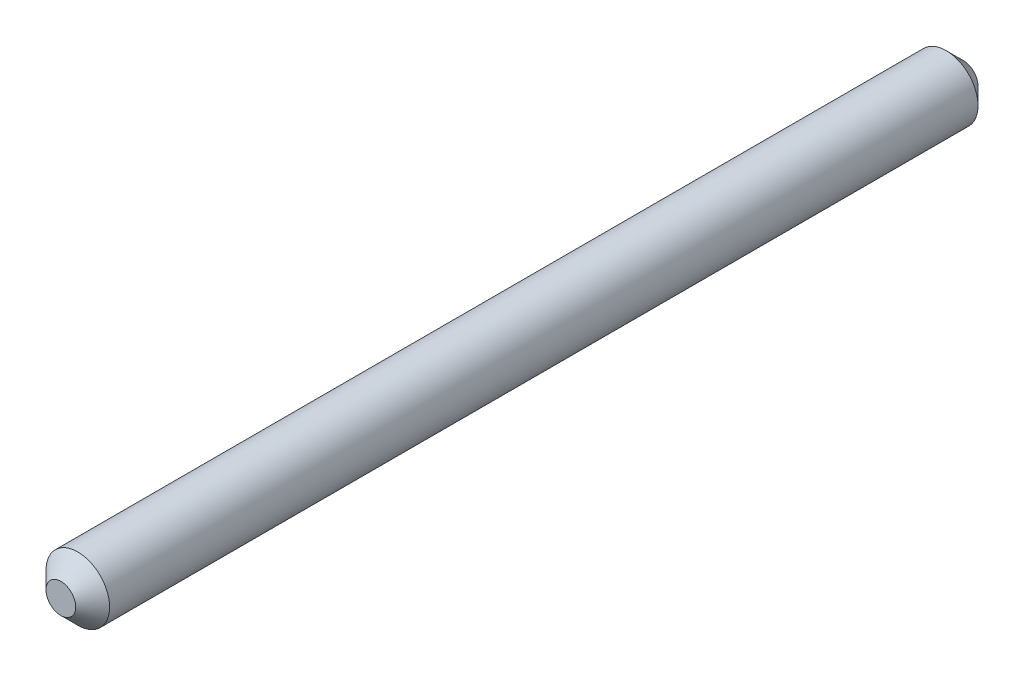
ISO-10303-21;
HEADER;
FILE_DESCRIPTION(('STEP AP214'),'2;1');
FILE_NAME('part.step','',(''),(''),'','','');
FILE_SCHEMA(('AUTOMOTIVE_DESIGN { 1 0 10303 214 1 1 1 1 }'));
ENDSEC;
DATA;
#1=APPLICATION_CONTEXT('core data for automotive mechanical design processes');
#2=APPLICATION_PROTOCOL_DEFINITION('international standard','automotive_design',2000,#1);
#3=PRODUCT_CONTEXT('',#1,'mechanical');
#4=PRODUCT('Part','Part','',(#3));
#5=PRODUCT_RELATED_PRODUCT_CATEGORY('part','',(#4));
#6=PRODUCT_DEFINITION_FORMATION('','',#4);
#7=PRODUCT_DEFINITION_CONTEXT('part definition',#1,'design');
#8=PRODUCT_DEFINITION('design','',#6,#7);
#9=PRODUCT_DEFINITION_SHAPE('','',#8);
#10=(LENGTH_UNIT() NAMED_UNIT(*) SI_UNIT(.MILLI.,.METRE.));
#11=(NAMED_UNIT(*) PLANE_ANGLE_UNIT() SI_UNIT($,.RADIAN.));
#12=(NAMED_UNIT(*) SI_UNIT($,.STERADIAN.) SOLID_ANGLE_UNIT());
#13=UNCERTAINTY_MEASURE_WITH_UNIT(LENGTH_MEASURE(1.E-05),#10,'distance_accuracy_value','');
#14=(GEOMETRIC_REPRESENTATION_CONTEXT(3) GLOBAL_UNCERTAINTY_ASSIGNED_CONTEXT((#13)) GLOBAL_UNIT_ASSIGNED_CONTEXT((#10,
#11,#12)) REPRESENTATION_CONTEXT('',''));
#15=CARTESIAN_POINT('',(0.,0.,0.));
#16=DIRECTION('',(0.,0.,1.));
#17=DIRECTION('',(1.,0.,0.));
#18=AXIS2_PLACEMENT_3D('',#15,#16,#17);
#19=CARTESIAN_POINT('',(0.,0.,-67.564));
#20=DIRECTION('',(0.,0.,1.));
#21=DIRECTION('',(1.,0.,0.));
#22=AXIS2_PLACEMENT_3D('',#19,#20,#21);
#23=CYLINDRICAL_SURFACE('',#22,2.38125);
#24=CARTESIAN_POINT('',(0.,0.,-66.294));
#25=DIRECTION('',(0.,0.,1.));
#26=DIRECTION('',(1.,0.,0.));
#27=AXIS2_PLACEMENT_3D('',#24,#25,#26);
#28=CIRCLE('',#27,2.38125);
#29=CARTESIAN_POINT('',(2.38125,0.,-66.294));
#30=VERTEX_POINT('',#29);
#31=EDGE_CURVE('E42',#30,#30,#28,.T.);
#32=ORIENTED_EDGE('',*,*,#31,.T.);
#33=EDGE_LOOP('',(#32));
#34=FACE_BOUND('',#33,.T.);
#35=CARTESIAN_POINT('',(0.,0.,-1.26999999999999));
#36=DIRECTION('',(0.,0.,1.));
#37=DIRECTION('',(1.,0.,0.));
#38=AXIS2_PLACEMENT_3D('',#35,#36,#37);
#39=CIRCLE('',#38,2.38125);
#40=CARTESIAN_POINT('',(2.38125,0.,-1.26999999999999));
#41=VERTEX_POINT('',#40);
#42=EDGE_CURVE('E46',#41,#41,#39,.F.);
#43=ORIENTED_EDGE('',*,*,#42,.T.);
#44=EDGE_LOOP('',(#43));
#45=FACE_BOUND('',#44,.T.);
#46=ADVANCED_FACE('F31',(#34,#45),#23,.T.);
#47=CARTESIAN_POINT('',(0.,0.,-67.564));
#48=DIRECTION('',(0.,0.,1.));
#49=DIRECTION('',(1.,0.,0.));
#50=AXIS2_PLACEMENT_3D('',#47,#48,#49);
#51=PLANE('',#50);
#52=CARTESIAN_POINT('',(0.,0.,-67.564));
#53=DIRECTION('',(0.,0.,1.));
#54=DIRECTION('',(1.,0.,0.));
#55=AXIS2_PLACEMENT_3D('',#52,#53,#54);
#56=CIRCLE('',#55,1.11124999999999);
#57=CARTESIAN_POINT('',(1.11124999999999,0.,-67.564));
#58=VERTEX_POINT('',#57);
#59=EDGE_CURVE('E38',#58,#58,#56,.F.);
#60=ORIENTED_EDGE('',*,*,#59,.T.);
#61=EDGE_LOOP('',(#60));
#62=FACE_BOUND('',#61,.T.);
#63=ADVANCED_FACE('F62',(#62),#51,.F.);
#64=CARTESIAN_POINT('',(0.,0.,0.));
#65=DIRECTION('',(0.,0.,1.));
#66=DIRECTION('',(1.,0.,0.));
#67=AXIS2_PLACEMENT_3D('',#64,#65,#66);
#68=PLANE('',#67);
#69=CARTESIAN_POINT('',(0.,0.,0.));
#70=DIRECTION('',(0.,0.,1.));
#71=DIRECTION('',(1.,0.,0.));
#72=AXIS2_PLACEMENT_3D('',#69,#70,#71);
#73=CIRCLE('',#72,1.11125);
#74=CARTESIAN_POINT('',(1.11125,0.,0.));
#75=VERTEX_POINT('',#74);
#76=EDGE_CURVE('E10',#75,#75,#73,.T.);
#77=ORIENTED_EDGE('',*,*,#76,.T.);
#78=EDGE_LOOP('',(#77));
#79=FACE_BOUND('',#78,.T.);
#80=ADVANCED_FACE('F59',(#79),#68,.T.);
#81=CARTESIAN_POINT('',(0.,0.,-66.294));
#82=DIRECTION('',(0.,0.,1.));
#83=DIRECTION('',(1.,0.,0.));
#84=AXIS2_PLACEMENT_3D('',#81,#82,#83);
#85=CONICAL_SURFACE('',#84,2.38125,0.785398163397448);
#86=ORIENTED_EDGE('',*,*,#59,.F.);
#87=EDGE_LOOP('',(#86));
#88=FACE_BOUND('',#87,.T.);
#89=ORIENTED_EDGE('',*,*,#31,.F.);
#90=EDGE_LOOP('',(#89));
#91=FACE_BOUND('',#90,.T.);
#92=ADVANCED_FACE('F55',(#88,#91),#85,.T.);
#93=CARTESIAN_POINT('',(0.,0.,0.));
#94=DIRECTION('',(0.,0.,-1.));
#95=DIRECTION('',(-1.,0.,0.));
#96=AXIS2_PLACEMENT_3D('',#93,#94,#95);
#97=CONICAL_SURFACE('',#96,1.11125,0.785398163397451);
#98=ORIENTED_EDGE('',*,*,#42,.F.);
#99=EDGE_LOOP('',(#98));
#100=FACE_BOUND('',#99,.T.);
#101=ORIENTED_EDGE('',*,*,#76,.F.);
#102=EDGE_LOOP('',(#101));
#103=FACE_BOUND('',#102,.T.);
#104=ADVANCED_FACE('F33',(#100,#103),#97,.T.);
#105=CLOSED_SHELL('',(#46,#63,#80,#92,#104));
#106=MANIFOLD_SOLID_BREP('B2',#105);
#107=ADVANCED_BREP_SHAPE_REPRESENTATION('',(#18,#106),#14);
#108=SHAPE_DEFINITION_REPRESENTATION(#9,#107);
ENDSEC;
END-ISO-10303-21;
